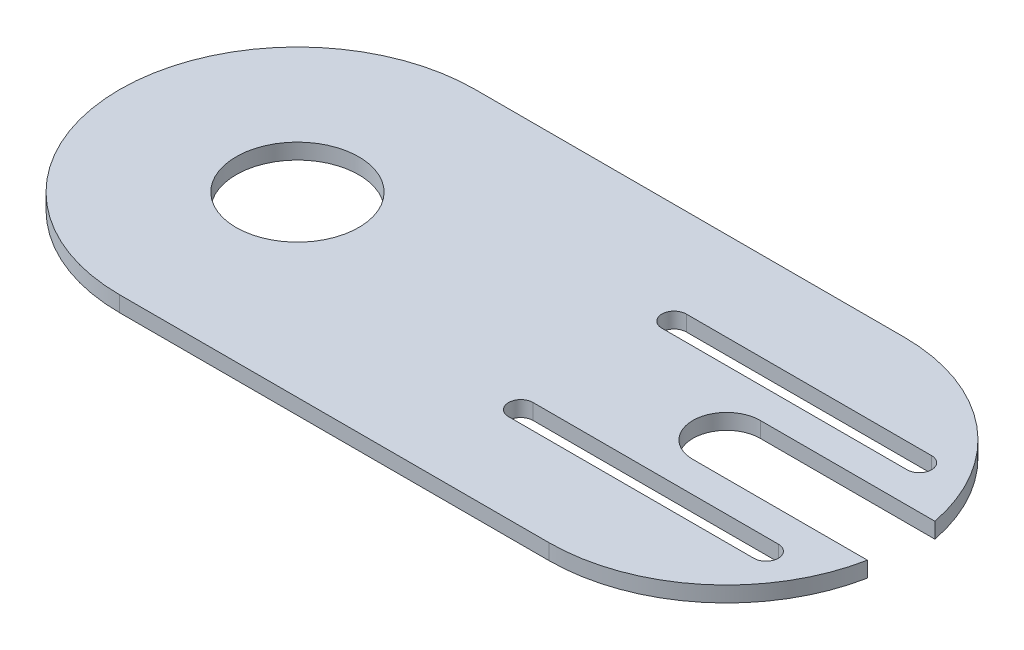
ISO-10303-21;
HEADER;
FILE_DESCRIPTION(('STEP AP214'),'2;1');
FILE_NAME('part.step','',(''),(''),'','','');
FILE_SCHEMA(('AUTOMOTIVE_DESIGN { 1 0 10303 214 1 1 1 1 }'));
ENDSEC;
DATA;
#1=APPLICATION_CONTEXT('core data for automotive mechanical design processes');
#2=APPLICATION_PROTOCOL_DEFINITION('international standard','automotive_design',2000,#1);
#3=PRODUCT_CONTEXT('',#1,'mechanical');
#4=PRODUCT('Part','Part','',(#3));
#5=PRODUCT_RELATED_PRODUCT_CATEGORY('part','',(#4));
#6=PRODUCT_DEFINITION_FORMATION('','',#4);
#7=PRODUCT_DEFINITION_CONTEXT('part definition',#1,'design');
#8=PRODUCT_DEFINITION('design','',#6,#7);
#9=PRODUCT_DEFINITION_SHAPE('','',#8);
#10=(LENGTH_UNIT() NAMED_UNIT(*) SI_UNIT(.MILLI.,.METRE.));
#11=(NAMED_UNIT(*) PLANE_ANGLE_UNIT() SI_UNIT($,.RADIAN.));
#12=(NAMED_UNIT(*) SI_UNIT($,.STERADIAN.) SOLID_ANGLE_UNIT());
#13=UNCERTAINTY_MEASURE_WITH_UNIT(LENGTH_MEASURE(1.E-05),#10,'distance_accuracy_value','');
#14=(GEOMETRIC_REPRESENTATION_CONTEXT(3) GLOBAL_UNCERTAINTY_ASSIGNED_CONTEXT((#13)) GLOBAL_UNIT_ASSIGNED_CONTEXT((#10,
#11,#12)) REPRESENTATION_CONTEXT('',''));
#15=CARTESIAN_POINT('',(0.,0.,0.));
#16=DIRECTION('',(0.,0.,1.));
#17=DIRECTION('',(1.,0.,0.));
#18=AXIS2_PLACEMENT_3D('',#15,#16,#17);
#19=CARTESIAN_POINT('',(0.,2.54,-10.5));
#20=DIRECTION('',(0.,0.,-1.));
#21=DIRECTION('',(-1.,0.,0.));
#22=AXIS2_PLACEMENT_3D('',#19,#20,#21);
#23=PLANE('',#22);
#24=DIRECTION('',(1.,0.,0.));
#25=VECTOR('',#24,1.);
#26=CARTESIAN_POINT('',(0.,0.,-10.5));
#27=LINE('',#26,#25);
#28=CARTESIAN_POINT('',(48.9401400666113,0.,-10.5));
#29=VERTEX_POINT('',#28);
#30=CARTESIAN_POINT('',(88.9401400666113,0.,-10.5));
#31=VERTEX_POINT('',#30);
#32=EDGE_CURVE('E286',#29,#31,#27,.T.);
#33=ORIENTED_EDGE('',*,*,#32,.F.);
#34=DIRECTION('',(0.,-1.,0.));
#35=VECTOR('',#34,1.);
#36=CARTESIAN_POINT('',(48.9401400666113,2.54,-10.5));
#37=LINE('',#36,#35);
#38=CARTESIAN_POINT('',(48.9401400666113,2.54,-10.5));
#39=VERTEX_POINT('',#38);
#40=EDGE_CURVE('E11',#39,#29,#37,.T.);
#41=ORIENTED_EDGE('',*,*,#40,.F.);
#42=DIRECTION('',(1.,0.,0.));
#43=VECTOR('',#42,1.);
#44=CARTESIAN_POINT('',(0.,2.54,-10.5));
#45=LINE('',#44,#43);
#46=CARTESIAN_POINT('',(88.9401400666113,2.54,-10.5));
#47=VERTEX_POINT('',#46);
#48=EDGE_CURVE('E179',#39,#47,#45,.T.);
#49=ORIENTED_EDGE('',*,*,#48,.T.);
#50=DIRECTION('',(0.,-1.,0.));
#51=VECTOR('',#50,1.);
#52=CARTESIAN_POINT('',(88.9401400666113,2.54,-10.5));
#53=LINE('',#52,#51);
#54=EDGE_CURVE('E119',#47,#31,#53,.T.);
#55=ORIENTED_EDGE('',*,*,#54,.T.);
#56=EDGE_LOOP('',(#33,#41,#49,#55));
#57=FACE_BOUND('',#56,.T.);
#58=ADVANCED_FACE('F41',(#57),#23,.T.);
#59=CARTESIAN_POINT('',(48.9401400666113,2.54,-12.5));
#60=DIRECTION('',(0.,-1.,0.));
#61=DIRECTION('',(0.,0.,-1.));
#62=AXIS2_PLACEMENT_3D('',#59,#60,#61);
#63=CYLINDRICAL_SURFACE('',#62,2.);
#64=CARTESIAN_POINT('',(48.9401400666113,0.,-12.5));
#65=DIRECTION('',(0.,1.,0.));
#66=DIRECTION('',(0.,0.,1.));
#67=AXIS2_PLACEMENT_3D('',#64,#65,#66);
#68=CIRCLE('',#67,2.);
#69=CARTESIAN_POINT('',(48.9401400666113,0.,-14.5));
#70=VERTEX_POINT('',#69);
#71=EDGE_CURVE('E185',#29,#70,#68,.F.);
#72=ORIENTED_EDGE('',*,*,#71,.T.);
#73=DIRECTION('',(0.,-1.,0.));
#74=VECTOR('',#73,1.);
#75=CARTESIAN_POINT('',(48.9401400666113,2.54,-14.5));
#76=LINE('',#75,#74);
#77=CARTESIAN_POINT('',(48.9401400666113,2.54,-14.5));
#78=VERTEX_POINT('',#77);
#79=EDGE_CURVE('E52',#78,#70,#76,.T.);
#80=ORIENTED_EDGE('',*,*,#79,.F.);
#81=CARTESIAN_POINT('',(48.9401400666113,2.54,-12.5));
#82=DIRECTION('',(0.,1.,0.));
#83=DIRECTION('',(0.,0.,1.));
#84=AXIS2_PLACEMENT_3D('',#81,#82,#83);
#85=CIRCLE('',#84,2.);
#86=EDGE_CURVE('E175',#39,#78,#85,.F.);
#87=ORIENTED_EDGE('',*,*,#86,.F.);
#88=ORIENTED_EDGE('',*,*,#40,.T.);
#89=EDGE_LOOP('',(#72,#80,#87,#88));
#90=FACE_BOUND('',#89,.T.);
#91=ADVANCED_FACE('F183',(#90),#63,.F.);
#92=CARTESIAN_POINT('',(0.,2.54,-14.5));
#93=DIRECTION('',(0.,0.,-1.));
#94=DIRECTION('',(-1.,0.,0.));
#95=AXIS2_PLACEMENT_3D('',#92,#93,#94);
#96=PLANE('',#95);
#97=DIRECTION('',(1.,0.,0.));
#98=VECTOR('',#97,1.);
#99=CARTESIAN_POINT('',(0.,0.,-14.5));
#100=LINE('',#99,#98);
#101=CARTESIAN_POINT('',(88.9401400666113,0.,-14.5));
#102=VERTEX_POINT('',#101);
#103=EDGE_CURVE('E291',#70,#102,#100,.T.);
#104=ORIENTED_EDGE('',*,*,#103,.T.);
#105=DIRECTION('',(0.,-1.,0.));
#106=VECTOR('',#105,1.);
#107=CARTESIAN_POINT('',(88.9401400666113,2.54,-14.5));
#108=LINE('',#107,#106);
#109=CARTESIAN_POINT('',(88.9401400666113,2.54,-14.5));
#110=VERTEX_POINT('',#109);
#111=EDGE_CURVE('E173',#110,#102,#108,.T.);
#112=ORIENTED_EDGE('',*,*,#111,.F.);
#113=DIRECTION('',(1.,0.,0.));
#114=VECTOR('',#113,1.);
#115=CARTESIAN_POINT('',(0.,2.54,-14.5));
#116=LINE('',#115,#114);
#117=EDGE_CURVE('E167',#78,#110,#116,.T.);
#118=ORIENTED_EDGE('',*,*,#117,.F.);
#119=ORIENTED_EDGE('',*,*,#79,.T.);
#120=EDGE_LOOP('',(#104,#112,#118,#119));
#121=FACE_BOUND('',#120,.T.);
#122=ADVANCED_FACE('F170',(#121),#96,.F.);
#123=CARTESIAN_POINT('',(88.9401400666113,2.54,12.5));
#124=DIRECTION('',(0.,-1.,0.));
#125=DIRECTION('',(0.,0.,-1.));
#126=AXIS2_PLACEMENT_3D('',#123,#124,#125);
#127=CYLINDRICAL_SURFACE('',#126,2.);
#128=CARTESIAN_POINT('',(88.9401400666113,0.,12.5));
#129=DIRECTION('',(0.,1.,0.));
#130=DIRECTION('',(0.,0.,1.));
#131=AXIS2_PLACEMENT_3D('',#128,#129,#130);
#132=CIRCLE('',#131,2.);
#133=CARTESIAN_POINT('',(88.9401400666113,0.,14.5));
#134=VERTEX_POINT('',#133);
#135=CARTESIAN_POINT('',(88.9401400666113,0.,10.5));
#136=VERTEX_POINT('',#135);
#137=EDGE_CURVE('E270',#134,#136,#132,.T.);
#138=ORIENTED_EDGE('',*,*,#137,.F.);
#139=DIRECTION('',(0.,-1.,0.));
#140=VECTOR('',#139,1.);
#141=CARTESIAN_POINT('',(88.9401400666113,2.54,14.5));
#142=LINE('',#141,#140);
#143=CARTESIAN_POINT('',(88.9401400666113,2.54,14.5));
#144=VERTEX_POINT('',#143);
#145=EDGE_CURVE('E201',#144,#134,#142,.T.);
#146=ORIENTED_EDGE('',*,*,#145,.F.);
#147=CARTESIAN_POINT('',(88.9401400666113,2.54,12.5));
#148=DIRECTION('',(0.,1.,0.));
#149=DIRECTION('',(0.,0.,1.));
#150=AXIS2_PLACEMENT_3D('',#147,#148,#149);
#151=CIRCLE('',#150,2.);
#152=CARTESIAN_POINT('',(88.9401400666113,2.54,10.5));
#153=VERTEX_POINT('',#152);
#154=EDGE_CURVE('E328',#144,#153,#151,.T.);
#155=ORIENTED_EDGE('',*,*,#154,.T.);
#156=DIRECTION('',(0.,-1.,0.));
#157=VECTOR('',#156,1.);
#158=CARTESIAN_POINT('',(88.9401400666113,2.54,10.5));
#159=LINE('',#158,#157);
#160=EDGE_CURVE('E192',#153,#136,#159,.T.);
#161=ORIENTED_EDGE('',*,*,#160,.T.);
#162=EDGE_LOOP('',(#138,#146,#155,#161));
#163=FACE_BOUND('',#162,.T.);
#164=ADVANCED_FACE('F399',(#163),#127,.F.);
#165=CARTESIAN_POINT('',(0.,2.54,14.5));
#166=DIRECTION('',(0.,0.,-1.));
#167=DIRECTION('',(-1.,0.,0.));
#168=AXIS2_PLACEMENT_3D('',#165,#166,#167);
#169=PLANE('',#168);
#170=DIRECTION('',(1.,0.,0.));
#171=VECTOR('',#170,1.);
#172=CARTESIAN_POINT('',(0.,0.,14.5));
#173=LINE('',#172,#171);
#174=CARTESIAN_POINT('',(48.9401400666113,0.,14.5));
#175=VERTEX_POINT('',#174);
#176=EDGE_CURVE('E274',#175,#134,#173,.T.);
#177=ORIENTED_EDGE('',*,*,#176,.F.);
#178=DIRECTION('',(0.,-1.,0.));
#179=VECTOR('',#178,1.);
#180=CARTESIAN_POINT('',(48.9401400666113,2.54,14.5));
#181=LINE('',#180,#179);
#182=CARTESIAN_POINT('',(48.9401400666113,2.54,14.5));
#183=VERTEX_POINT('',#182);
#184=EDGE_CURVE('E198',#183,#175,#181,.T.);
#185=ORIENTED_EDGE('',*,*,#184,.F.);
#186=DIRECTION('',(1.,0.,0.));
#187=VECTOR('',#186,1.);
#188=CARTESIAN_POINT('',(0.,2.54,14.5));
#189=LINE('',#188,#187);
#190=EDGE_CURVE('E332',#183,#144,#189,.T.);
#191=ORIENTED_EDGE('',*,*,#190,.T.);
#192=ORIENTED_EDGE('',*,*,#145,.T.);
#193=EDGE_LOOP('',(#177,#185,#191,#192));
#194=FACE_BOUND('',#193,.T.);
#195=ADVANCED_FACE('F395',(#194),#169,.T.);
#196=CARTESIAN_POINT('',(48.9401400666113,2.54,12.5));
#197=DIRECTION('',(0.,-1.,0.));
#198=DIRECTION('',(0.,0.,-1.));
#199=AXIS2_PLACEMENT_3D('',#196,#197,#198);
#200=CYLINDRICAL_SURFACE('',#199,2.);
#201=CARTESIAN_POINT('',(48.9401400666113,0.,12.5));
#202=DIRECTION('',(0.,1.,0.));
#203=DIRECTION('',(0.,0.,1.));
#204=AXIS2_PLACEMENT_3D('',#201,#202,#203);
#205=CIRCLE('',#204,2.);
#206=CARTESIAN_POINT('',(48.9401400666113,0.,10.5));
#207=VERTEX_POINT('',#206);
#208=EDGE_CURVE('E278',#207,#175,#205,.T.);
#209=ORIENTED_EDGE('',*,*,#208,.F.);
#210=DIRECTION('',(0.,-1.,0.));
#211=VECTOR('',#210,1.);
#212=CARTESIAN_POINT('',(48.9401400666113,2.54,10.5));
#213=LINE('',#212,#211);
#214=CARTESIAN_POINT('',(48.9401400666113,2.54,10.5));
#215=VERTEX_POINT('',#214);
#216=EDGE_CURVE('E195',#215,#207,#213,.T.);
#217=ORIENTED_EDGE('',*,*,#216,.F.);
#218=CARTESIAN_POINT('',(48.9401400666113,2.54,12.5));
#219=DIRECTION('',(0.,1.,0.));
#220=DIRECTION('',(0.,0.,1.));
#221=AXIS2_PLACEMENT_3D('',#218,#219,#220);
#222=CIRCLE('',#221,2.);
#223=EDGE_CURVE('E336',#215,#183,#222,.T.);
#224=ORIENTED_EDGE('',*,*,#223,.T.);
#225=ORIENTED_EDGE('',*,*,#184,.T.);
#226=EDGE_LOOP('',(#209,#217,#224,#225));
#227=FACE_BOUND('',#226,.T.);
#228=ADVANCED_FACE('F392',(#227),#200,.F.);
#229=CARTESIAN_POINT('',(0.,2.54,0.));
#230=DIRECTION('',(0.,-1.,0.));
#231=DIRECTION('',(0.,0.,-1.));
#232=AXIS2_PLACEMENT_3D('',#229,#230,#231);
#233=CYLINDRICAL_SURFACE('',#232,29.);
#234=CARTESIAN_POINT('',(0.,0.,0.));
#235=DIRECTION('',(0.,1.,0.));
#236=DIRECTION('',(0.,0.,1.));
#237=AXIS2_PLACEMENT_3D('',#234,#235,#236);
#238=CIRCLE('',#237,29.);
#239=CARTESIAN_POINT('',(0.,0.,-29.));
#240=VERTEX_POINT('',#239);
#241=CARTESIAN_POINT('',(0.,0.,29.));
#242=VERTEX_POINT('',#241);
#243=EDGE_CURVE('E236',#240,#242,#238,.T.);
#244=ORIENTED_EDGE('',*,*,#243,.T.);
#245=DIRECTION('',(0.,-1.,0.));
#246=VECTOR('',#245,1.);
#247=CARTESIAN_POINT('',(0.,2.54,29.));
#248=LINE('',#247,#246);
#249=CARTESIAN_POINT('',(0.,2.54,29.));
#250=VERTEX_POINT('',#249);
#251=EDGE_CURVE('E45',#250,#242,#248,.T.);
#252=ORIENTED_EDGE('',*,*,#251,.F.);
#253=CARTESIAN_POINT('',(0.,2.54,0.));
#254=DIRECTION('',(0.,1.,0.));
#255=DIRECTION('',(0.,0.,1.));
#256=AXIS2_PLACEMENT_3D('',#253,#254,#255);
#257=CIRCLE('',#256,29.);
#258=CARTESIAN_POINT('',(0.,2.54,-29.));
#259=VERTEX_POINT('',#258);
#260=EDGE_CURVE('E300',#259,#250,#257,.T.);
#261=ORIENTED_EDGE('',*,*,#260,.F.);
#262=DIRECTION('',(0.,-1.,0.));
#263=VECTOR('',#262,1.);
#264=CARTESIAN_POINT('',(0.,2.54,-29.));
#265=LINE('',#264,#263);
#266=EDGE_CURVE('E204',#259,#240,#265,.T.);
#267=ORIENTED_EDGE('',*,*,#266,.T.);
#268=EDGE_LOOP('',(#244,#252,#261,#267));
#269=FACE_BOUND('',#268,.T.);
#270=ADVANCED_FACE('F237',(#269),#233,.T.);
#271=CARTESIAN_POINT('',(0.,2.54,29.));
#272=DIRECTION('',(0.,0.,-1.));
#273=DIRECTION('',(-1.,0.,0.));
#274=AXIS2_PLACEMENT_3D('',#271,#272,#273);
#275=PLANE('',#274);
#276=DIRECTION('',(1.,0.,0.));
#277=VECTOR('',#276,1.);
#278=CARTESIAN_POINT('',(0.,0.,29.));
#279=LINE('',#278,#277);
#280=CARTESIAN_POINT('',(70.,0.,29.));
#281=VERTEX_POINT('',#280);
#282=EDGE_CURVE('E231',#242,#281,#279,.T.);
#283=ORIENTED_EDGE('',*,*,#282,.T.);
#284=DIRECTION('',(0.,-1.,0.));
#285=VECTOR('',#284,1.);
#286=CARTESIAN_POINT('',(70.,2.54,29.));
#287=LINE('',#286,#285);
#288=CARTESIAN_POINT('',(70.,2.54,29.));
#289=VERTEX_POINT('',#288);
#290=EDGE_CURVE('E221',#289,#281,#287,.T.);
#291=ORIENTED_EDGE('',*,*,#290,.F.);
#292=DIRECTION('',(1.,0.,0.));
#293=VECTOR('',#292,1.);
#294=CARTESIAN_POINT('',(0.,2.54,29.));
#295=LINE('',#294,#293);
#296=EDGE_CURVE('E127',#250,#289,#295,.T.);
#297=ORIENTED_EDGE('',*,*,#296,.F.);
#298=ORIENTED_EDGE('',*,*,#251,.T.);
#299=EDGE_LOOP('',(#283,#291,#297,#298));
#300=FACE_BOUND('',#299,.T.);
#301=ADVANCED_FACE('F230',(#300),#275,.F.);
#302=CARTESIAN_POINT('',(70.,2.54,0.));
#303=DIRECTION('',(0.,-1.,0.));
#304=DIRECTION('',(0.,0.,-1.));
#305=AXIS2_PLACEMENT_3D('',#302,#303,#304);
#306=CYLINDRICAL_SURFACE('',#305,29.);
#307=CARTESIAN_POINT('',(70.,0.,0.));
#308=DIRECTION('',(0.,1.,0.));
#309=DIRECTION('',(0.,0.,1.));
#310=AXIS2_PLACEMENT_3D('',#307,#308,#309);
#311=CIRCLE('',#310,29.);
#312=CARTESIAN_POINT('',(98.4736720498077,0.,5.5));
#313=VERTEX_POINT('',#312);
#314=EDGE_CURVE('E246',#313,#281,#311,.F.);
#315=ORIENTED_EDGE('',*,*,#314,.F.);
#316=DIRECTION('',(0.,-1.,0.));
#317=VECTOR('',#316,1.);
#318=CARTESIAN_POINT('',(98.4736720498077,2.54,5.5));
#319=LINE('',#318,#317);
#320=CARTESIAN_POINT('',(98.4736720498077,2.54,5.5));
#321=VERTEX_POINT('',#320);
#322=EDGE_CURVE('E219',#321,#313,#319,.T.);
#323=ORIENTED_EDGE('',*,*,#322,.F.);
#324=CARTESIAN_POINT('',(70.,2.54,0.));
#325=DIRECTION('',(0.,1.,0.));
#326=DIRECTION('',(0.,0.,1.));
#327=AXIS2_PLACEMENT_3D('',#324,#325,#326);
#328=CIRCLE('',#327,29.);
#329=EDGE_CURVE('E309',#321,#289,#328,.F.);
#330=ORIENTED_EDGE('',*,*,#329,.T.);
#331=ORIENTED_EDGE('',*,*,#290,.T.);
#332=EDGE_LOOP('',(#315,#323,#330,#331));
#333=FACE_BOUND('',#332,.T.);
#334=ADVANCED_FACE('F361',(#333),#306,.T.);
#335=CARTESIAN_POINT('',(0.,2.54,5.5));
#336=DIRECTION('',(0.,0.,-1.));
#337=DIRECTION('',(-1.,0.,0.));
#338=AXIS2_PLACEMENT_3D('',#335,#336,#337);
#339=PLANE('',#338);
#340=DIRECTION('',(1.,0.,0.));
#341=VECTOR('',#340,1.);
#342=CARTESIAN_POINT('',(0.,0.,5.5));
#343=LINE('',#342,#341);
#344=CARTESIAN_POINT('',(70.,0.,5.5));
#345=VERTEX_POINT('',#344);
#346=EDGE_CURVE('E254',#345,#313,#343,.T.);
#347=ORIENTED_EDGE('',*,*,#346,.F.);
#348=DIRECTION('',(0.,-1.,0.));
#349=VECTOR('',#348,1.);
#350=CARTESIAN_POINT('',(70.,2.54,5.5));
#351=LINE('',#350,#349);
#352=CARTESIAN_POINT('',(70.,2.54,5.5));
#353=VERTEX_POINT('',#352);
#354=EDGE_CURVE('E216',#353,#345,#351,.T.);
#355=ORIENTED_EDGE('',*,*,#354,.F.);
#356=DIRECTION('',(1.,0.,0.));
#357=VECTOR('',#356,1.);
#358=CARTESIAN_POINT('',(0.,2.54,5.5));
#359=LINE('',#358,#357);
#360=EDGE_CURVE('E312',#353,#321,#359,.T.);
#361=ORIENTED_EDGE('',*,*,#360,.T.);
#362=ORIENTED_EDGE('',*,*,#322,.T.);
#363=EDGE_LOOP('',(#347,#355,#361,#362));
#364=FACE_BOUND('',#363,.T.);
#365=ADVANCED_FACE('F364',(#364),#339,.T.);
#366=CARTESIAN_POINT('',(70.,2.54,0.));
#367=DIRECTION('',(0.,-1.,0.));
#368=DIRECTION('',(0.,0.,-1.));
#369=AXIS2_PLACEMENT_3D('',#366,#367,#368);
#370=CYLINDRICAL_SURFACE('',#369,5.5);
#371=CARTESIAN_POINT('',(70.,0.,0.));
#372=DIRECTION('',(0.,1.,0.));
#373=DIRECTION('',(0.,0.,1.));
#374=AXIS2_PLACEMENT_3D('',#371,#372,#373);
#375=CIRCLE('',#374,5.5);
#376=CARTESIAN_POINT('',(70.,0.,-5.5));
#377=VERTEX_POINT('',#376);
#378=EDGE_CURVE('E259',#377,#345,#375,.T.);
#379=ORIENTED_EDGE('',*,*,#378,.F.);
#380=DIRECTION('',(0.,-1.,0.));
#381=VECTOR('',#380,1.);
#382=CARTESIAN_POINT('',(70.,2.54,-5.5));
#383=LINE('',#382,#381);
#384=CARTESIAN_POINT('',(70.,2.54,-5.5));
#385=VERTEX_POINT('',#384);
#386=EDGE_CURVE('E213',#385,#377,#383,.T.);
#387=ORIENTED_EDGE('',*,*,#386,.F.);
#388=CARTESIAN_POINT('',(70.,2.54,0.));
#389=DIRECTION('',(0.,1.,0.));
#390=DIRECTION('',(0.,0.,1.));
#391=AXIS2_PLACEMENT_3D('',#388,#389,#390);
#392=CIRCLE('',#391,5.5);
#393=EDGE_CURVE('E317',#385,#353,#392,.T.);
#394=ORIENTED_EDGE('',*,*,#393,.T.);
#395=ORIENTED_EDGE('',*,*,#354,.T.);
#396=EDGE_LOOP('',(#379,#387,#394,#395));
#397=FACE_BOUND('',#396,.T.);
#398=ADVANCED_FACE('F367',(#397),#370,.F.);
#399=CARTESIAN_POINT('',(0.,2.54,-5.5));
#400=DIRECTION('',(0.,0.,-1.));
#401=DIRECTION('',(-1.,0.,0.));
#402=AXIS2_PLACEMENT_3D('',#399,#400,#401);
#403=PLANE('',#402);
#404=DIRECTION('',(1.,0.,0.));
#405=VECTOR('',#404,1.);
#406=CARTESIAN_POINT('',(0.,0.,-5.5));
#407=LINE('',#406,#405);
#408=CARTESIAN_POINT('',(98.4736720498077,0.,-5.5));
#409=VERTEX_POINT('',#408);
#410=EDGE_CURVE('E263',#377,#409,#407,.T.);
#411=ORIENTED_EDGE('',*,*,#410,.T.);
#412=DIRECTION('',(0.,-1.,0.));
#413=VECTOR('',#412,1.);
#414=CARTESIAN_POINT('',(98.4736720498077,2.54,-5.5));
#415=LINE('',#414,#413);
#416=CARTESIAN_POINT('',(98.4736720498077,2.54,-5.5));
#417=VERTEX_POINT('',#416);
#418=EDGE_CURVE('E210',#417,#409,#415,.T.);
#419=ORIENTED_EDGE('',*,*,#418,.F.);
#420=DIRECTION('',(1.,0.,0.));
#421=VECTOR('',#420,1.);
#422=CARTESIAN_POINT('',(0.,2.54,-5.5));
#423=LINE('',#422,#421);
#424=EDGE_CURVE('E321',#385,#417,#423,.T.);
#425=ORIENTED_EDGE('',*,*,#424,.F.);
#426=ORIENTED_EDGE('',*,*,#386,.T.);
#427=EDGE_LOOP('',(#411,#419,#425,#426));
#428=FACE_BOUND('',#427,.T.);
#429=ADVANCED_FACE('F370',(#428),#403,.F.);
#430=CARTESIAN_POINT('',(70.,0.,-29.));
#431=VERTEX_POINT('',#430);
#432=EDGE_CURVE('E255',#431,#409,#311,.F.);
#433=ORIENTED_EDGE('',*,*,#432,.F.);
#434=DIRECTION('',(0.,-1.,0.));
#435=VECTOR('',#434,1.);
#436=CARTESIAN_POINT('',(70.,2.54,-29.));
#437=LINE('',#436,#435);
#438=CARTESIAN_POINT('',(70.,2.54,-29.));
#439=VERTEX_POINT('',#438);
#440=EDGE_CURVE('E207',#439,#431,#437,.T.);
#441=ORIENTED_EDGE('',*,*,#440,.F.);
#442=EDGE_CURVE('E313',#439,#417,#328,.F.);
#443=ORIENTED_EDGE('',*,*,#442,.T.);
#444=ORIENTED_EDGE('',*,*,#418,.T.);
#445=EDGE_LOOP('',(#433,#441,#443,#444));
#446=FACE_BOUND('',#445,.T.);
#447=ADVANCED_FACE('F350',(#446),#306,.T.);
#448=CARTESIAN_POINT('',(0.,2.54,10.5));
#449=DIRECTION('',(0.,0.,-1.));
#450=DIRECTION('',(-1.,0.,0.));
#451=AXIS2_PLACEMENT_3D('',#448,#449,#450);
#452=PLANE('',#451);
#453=DIRECTION('',(1.,0.,0.));
#454=VECTOR('',#453,1.);
#455=CARTESIAN_POINT('',(0.,0.,10.5));
#456=LINE('',#455,#454);
#457=EDGE_CURVE('E282',#207,#136,#456,.T.);
#458=ORIENTED_EDGE('',*,*,#457,.T.);
#459=ORIENTED_EDGE('',*,*,#160,.F.);
#460=DIRECTION('',(1.,0.,0.));
#461=VECTOR('',#460,1.);
#462=CARTESIAN_POINT('',(0.,2.54,10.5));
#463=LINE('',#462,#461);
#464=EDGE_CURVE('E340',#215,#153,#463,.T.);
#465=ORIENTED_EDGE('',*,*,#464,.F.);
#466=ORIENTED_EDGE('',*,*,#216,.T.);
#467=EDGE_LOOP('',(#458,#459,#465,#466));
#468=FACE_BOUND('',#467,.T.);
#469=ADVANCED_FACE('F388',(#468),#452,.F.);
#470=CARTESIAN_POINT('',(0.,2.54,-29.));
#471=DIRECTION('',(0.,0.,-1.));
#472=DIRECTION('',(-1.,0.,0.));
#473=AXIS2_PLACEMENT_3D('',#470,#471,#472);
#474=PLANE('',#473);
#475=DIRECTION('',(1.,0.,0.));
#476=VECTOR('',#475,1.);
#477=CARTESIAN_POINT('',(0.,0.,-29.));
#478=LINE('',#477,#476);
#479=EDGE_CURVE('E267',#240,#431,#478,.T.);
#480=ORIENTED_EDGE('',*,*,#479,.F.);
#481=ORIENTED_EDGE('',*,*,#266,.F.);
#482=DIRECTION('',(1.,0.,0.));
#483=VECTOR('',#482,1.);
#484=CARTESIAN_POINT('',(0.,2.54,-29.));
#485=LINE('',#484,#483);
#486=EDGE_CURVE('E324',#259,#439,#485,.T.);
#487=ORIENTED_EDGE('',*,*,#486,.T.);
#488=ORIENTED_EDGE('',*,*,#440,.T.);
#489=EDGE_LOOP('',(#480,#481,#487,#488));
#490=FACE_BOUND('',#489,.T.);
#491=ADVANCED_FACE('F358',(#490),#474,.T.);
#492=CARTESIAN_POINT('',(0.,2.54,0.));
#493=DIRECTION('',(0.,-1.,0.));
#494=DIRECTION('',(0.,0.,-1.));
#495=AXIS2_PLACEMENT_3D('',#492,#493,#494);
#496=CYLINDRICAL_SURFACE('',#495,10.);
#497=CARTESIAN_POINT('',(0.,2.54,0.));
#498=DIRECTION('',(0.,1.,0.));
#499=DIRECTION('',(0.,0.,1.));
#500=AXIS2_PLACEMENT_3D('',#497,#498,#499);
#501=CIRCLE('',#500,10.);
#502=CARTESIAN_POINT('',(0.,2.54,10.));
#503=VERTEX_POINT('',#502);
#504=EDGE_CURVE('E295',#503,#503,#501,.T.);
#505=ORIENTED_EDGE('',*,*,#504,.T.);
#506=EDGE_LOOP('',(#505));
#507=FACE_BOUND('',#506,.T.);
#508=CARTESIAN_POINT('',(0.,0.,0.));
#509=DIRECTION('',(0.,1.,0.));
#510=DIRECTION('',(0.,0.,1.));
#511=AXIS2_PLACEMENT_3D('',#508,#509,#510);
#512=CIRCLE('',#511,10.);
#513=CARTESIAN_POINT('',(0.,0.,10.));
#514=VERTEX_POINT('',#513);
#515=EDGE_CURVE('E242',#514,#514,#512,.T.);
#516=ORIENTED_EDGE('',*,*,#515,.F.);
#517=EDGE_LOOP('',(#516));
#518=FACE_BOUND('',#517,.T.);
#519=ADVANCED_FACE('F43',(#507,#518),#496,.F.);
#520=CARTESIAN_POINT('',(88.9401400666113,2.54,-12.5));
#521=DIRECTION('',(0.,-1.,0.));
#522=DIRECTION('',(0.,0.,-1.));
#523=AXIS2_PLACEMENT_3D('',#520,#521,#522);
#524=CYLINDRICAL_SURFACE('',#523,2.);
#525=CARTESIAN_POINT('',(88.9401400666113,0.,-12.5));
#526=DIRECTION('',(0.,1.,0.));
#527=DIRECTION('',(0.,0.,1.));
#528=AXIS2_PLACEMENT_3D('',#525,#526,#527);
#529=CIRCLE('',#528,2.);
#530=EDGE_CURVE('E112',#102,#31,#529,.F.);
#531=ORIENTED_EDGE('',*,*,#530,.T.);
#532=ORIENTED_EDGE('',*,*,#54,.F.);
#533=CARTESIAN_POINT('',(88.9401400666113,2.54,-12.5));
#534=DIRECTION('',(0.,1.,0.));
#535=DIRECTION('',(0.,0.,1.));
#536=AXIS2_PLACEMENT_3D('',#533,#534,#535);
#537=CIRCLE('',#536,2.);
#538=EDGE_CURVE('E61',#110,#47,#537,.F.);
#539=ORIENTED_EDGE('',*,*,#538,.F.);
#540=ORIENTED_EDGE('',*,*,#111,.T.);
#541=EDGE_LOOP('',(#531,#532,#539,#540));
#542=FACE_BOUND('',#541,.T.);
#543=ADVANCED_FACE('F459',(#542),#524,.F.);
#544=CARTESIAN_POINT('',(0.,2.54,0.));
#545=DIRECTION('',(0.,1.,0.));
#546=DIRECTION('',(0.,0.,1.));
#547=AXIS2_PLACEMENT_3D('',#544,#545,#546);
#548=PLANE('',#547);
#549=ORIENTED_EDGE('',*,*,#504,.F.);
#550=EDGE_LOOP('',(#549));
#551=FACE_BOUND('',#550,.T.);
#552=ORIENTED_EDGE('',*,*,#260,.T.);
#553=ORIENTED_EDGE('',*,*,#296,.T.);
#554=ORIENTED_EDGE('',*,*,#329,.F.);
#555=ORIENTED_EDGE('',*,*,#360,.F.);
#556=ORIENTED_EDGE('',*,*,#393,.F.);
#557=ORIENTED_EDGE('',*,*,#424,.T.);
#558=ORIENTED_EDGE('',*,*,#442,.F.);
#559=ORIENTED_EDGE('',*,*,#486,.F.);
#560=EDGE_LOOP('',(#552,#553,#554,#555,#556,#557,#558,#559));
#561=FACE_BOUND('',#560,.T.);
#562=ORIENTED_EDGE('',*,*,#154,.F.);
#563=ORIENTED_EDGE('',*,*,#190,.F.);
#564=ORIENTED_EDGE('',*,*,#223,.F.);
#565=ORIENTED_EDGE('',*,*,#464,.T.);
#566=EDGE_LOOP('',(#562,#563,#564,#565));
#567=FACE_BOUND('',#566,.T.);
#568=ORIENTED_EDGE('',*,*,#48,.F.);
#569=ORIENTED_EDGE('',*,*,#86,.T.);
#570=ORIENTED_EDGE('',*,*,#117,.T.);
#571=ORIENTED_EDGE('',*,*,#538,.T.);
#572=EDGE_LOOP('',(#568,#569,#570,#571));
#573=FACE_BOUND('',#572,.T.);
#574=ADVANCED_FACE('F178',(#551,#561,#567,#573),#548,.T.);
#575=CARTESIAN_POINT('',(0.,0.,0.));
#576=DIRECTION('',(0.,1.,0.));
#577=DIRECTION('',(0.,0.,1.));
#578=AXIS2_PLACEMENT_3D('',#575,#576,#577);
#579=PLANE('',#578);
#580=ORIENTED_EDGE('',*,*,#515,.T.);
#581=EDGE_LOOP('',(#580));
#582=FACE_BOUND('',#581,.T.);
#583=ORIENTED_EDGE('',*,*,#243,.F.);
#584=ORIENTED_EDGE('',*,*,#479,.T.);
#585=ORIENTED_EDGE('',*,*,#432,.T.);
#586=ORIENTED_EDGE('',*,*,#410,.F.);
#587=ORIENTED_EDGE('',*,*,#378,.T.);
#588=ORIENTED_EDGE('',*,*,#346,.T.);
#589=ORIENTED_EDGE('',*,*,#314,.T.);
#590=ORIENTED_EDGE('',*,*,#282,.F.);
#591=EDGE_LOOP('',(#583,#584,#585,#586,#587,#588,#589,#590));
#592=FACE_BOUND('',#591,.T.);
#593=ORIENTED_EDGE('',*,*,#137,.T.);
#594=ORIENTED_EDGE('',*,*,#457,.F.);
#595=ORIENTED_EDGE('',*,*,#208,.T.);
#596=ORIENTED_EDGE('',*,*,#176,.T.);
#597=EDGE_LOOP('',(#593,#594,#595,#596));
#598=FACE_BOUND('',#597,.T.);
#599=ORIENTED_EDGE('',*,*,#32,.T.);
#600=ORIENTED_EDGE('',*,*,#530,.F.);
#601=ORIENTED_EDGE('',*,*,#103,.F.);
#602=ORIENTED_EDGE('',*,*,#71,.F.);
#603=EDGE_LOOP('',(#599,#600,#601,#602));
#604=FACE_BOUND('',#603,.T.);
#605=ADVANCED_FACE('F372',(#582,#592,#598,#604),#579,.F.);
#606=CLOSED_SHELL('',(#58,#91,#122,#164,#195,#228,#270,#301,#334,#365,#398,#429,#447,#469,#491,
#519,#543,#574,#605));
#607=MANIFOLD_SOLID_BREP('B2',#606);
#608=ADVANCED_BREP_SHAPE_REPRESENTATION('',(#18,#607),#14);
#609=SHAPE_DEFINITION_REPRESENTATION(#9,#608);
ENDSEC;
END-ISO-10303-21;
